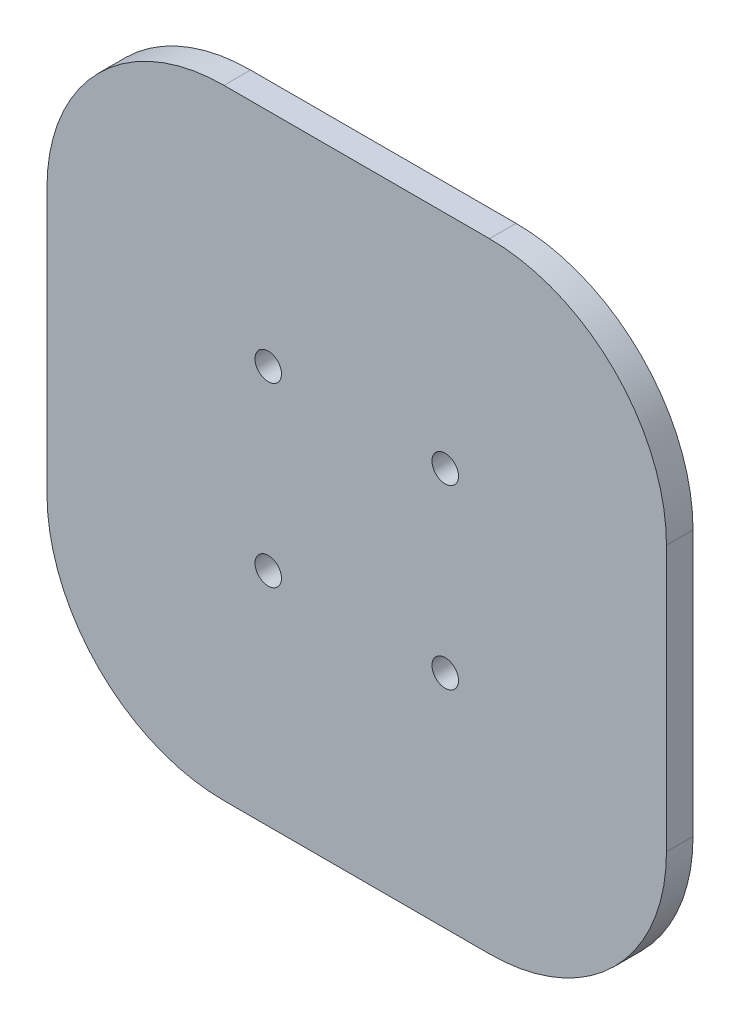
ISO-10303-21;
HEADER;
FILE_DESCRIPTION(('STEP AP214'),'2;1');
FILE_NAME('part.step','',(''),(''),'','','');
FILE_SCHEMA(('AUTOMOTIVE_DESIGN { 1 0 10303 214 1 1 1 1 }'));
ENDSEC;
DATA;
#1=APPLICATION_CONTEXT('core data for automotive mechanical design processes');
#2=APPLICATION_PROTOCOL_DEFINITION('international standard','automotive_design',2000,#1);
#3=PRODUCT_CONTEXT('',#1,'mechanical');
#4=PRODUCT('Part','Part','',(#3));
#5=PRODUCT_RELATED_PRODUCT_CATEGORY('part','',(#4));
#6=PRODUCT_DEFINITION_FORMATION('','',#4);
#7=PRODUCT_DEFINITION_CONTEXT('part definition',#1,'design');
#8=PRODUCT_DEFINITION('design','',#6,#7);
#9=PRODUCT_DEFINITION_SHAPE('','',#8);
#10=(LENGTH_UNIT() NAMED_UNIT(*) SI_UNIT(.MILLI.,.METRE.));
#11=(NAMED_UNIT(*) PLANE_ANGLE_UNIT() SI_UNIT($,.RADIAN.));
#12=(NAMED_UNIT(*) SI_UNIT($,.STERADIAN.) SOLID_ANGLE_UNIT());
#13=UNCERTAINTY_MEASURE_WITH_UNIT(LENGTH_MEASURE(1.E-05),#10,'distance_accuracy_value','');
#14=(GEOMETRIC_REPRESENTATION_CONTEXT(3) GLOBAL_UNCERTAINTY_ASSIGNED_CONTEXT((#13)) GLOBAL_UNIT_ASSIGNED_CONTEXT((#10,
#11,#12)) REPRESENTATION_CONTEXT('',''));
#15=CARTESIAN_POINT('',(0.,0.,0.));
#16=DIRECTION('',(0.,0.,1.));
#17=DIRECTION('',(1.,0.,0.));
#18=AXIS2_PLACEMENT_3D('',#15,#16,#17);
#19=CARTESIAN_POINT('',(-15.,-15.,3.));
#20=DIRECTION('',(0.,0.,-1.));
#21=DIRECTION('',(-1.,0.,0.));
#22=AXIS2_PLACEMENT_3D('',#19,#20,#21);
#23=CYLINDRICAL_SURFACE('',#22,20.);
#24=CARTESIAN_POINT('',(-15.,-15.,0.));
#25=DIRECTION('',(0.,0.,-1.));
#26=DIRECTION('',(-1.,0.,0.));
#27=AXIS2_PLACEMENT_3D('',#24,#25,#26);
#28=CIRCLE('',#27,20.);
#29=CARTESIAN_POINT('',(-15.,-35.,0.));
#30=VERTEX_POINT('',#29);
#31=CARTESIAN_POINT('',(-35.,-15.,0.));
#32=VERTEX_POINT('',#31);
#33=EDGE_CURVE('E132',#30,#32,#28,.T.);
#34=ORIENTED_EDGE('',*,*,#33,.F.);
#35=DIRECTION('',(0.,0.,-1.));
#36=VECTOR('',#35,1.);
#37=CARTESIAN_POINT('',(-15.,-35.,3.));
#38=LINE('',#37,#36);
#39=CARTESIAN_POINT('',(-15.,-35.,3.));
#40=VERTEX_POINT('',#39);
#41=EDGE_CURVE('E11',#40,#30,#38,.T.);
#42=ORIENTED_EDGE('',*,*,#41,.F.);
#43=CARTESIAN_POINT('',(-15.,-15.,3.));
#44=DIRECTION('',(0.,0.,-1.));
#45=DIRECTION('',(-1.,0.,0.));
#46=AXIS2_PLACEMENT_3D('',#43,#44,#45);
#47=CIRCLE('',#46,20.);
#48=CARTESIAN_POINT('',(-35.,-15.,3.));
#49=VERTEX_POINT('',#48);
#50=EDGE_CURVE('E151',#40,#49,#47,.T.);
#51=ORIENTED_EDGE('',*,*,#50,.T.);
#52=DIRECTION('',(0.,0.,-1.));
#53=VECTOR('',#52,1.);
#54=CARTESIAN_POINT('',(-35.,-15.,3.));
#55=LINE('',#54,#53);
#56=EDGE_CURVE('E36',#49,#32,#55,.T.);
#57=ORIENTED_EDGE('',*,*,#56,.T.);
#58=EDGE_LOOP('',(#34,#42,#51,#57));
#59=FACE_BOUND('',#58,.T.);
#60=ADVANCED_FACE('F33',(#59),#23,.T.);
#61=CARTESIAN_POINT('',(-15.,-35.,3.));
#62=DIRECTION('',(0.,1.,0.));
#63=DIRECTION('',(0.,0.,1.));
#64=AXIS2_PLACEMENT_3D('',#61,#62,#63);
#65=PLANE('',#64);
#66=DIRECTION('',(1.,0.,0.));
#67=VECTOR('',#66,1.);
#68=CARTESIAN_POINT('',(-15.,-35.,0.));
#69=LINE('',#68,#67);
#70=CARTESIAN_POINT('',(15.,-35.,0.));
#71=VERTEX_POINT('',#70);
#72=EDGE_CURVE('E78',#30,#71,#69,.T.);
#73=ORIENTED_EDGE('',*,*,#72,.T.);
#74=DIRECTION('',(0.,0.,-1.));
#75=VECTOR('',#74,1.);
#76=CARTESIAN_POINT('',(15.,-35.,3.));
#77=LINE('',#76,#75);
#78=CARTESIAN_POINT('',(15.,-35.,3.));
#79=VERTEX_POINT('',#78);
#80=EDGE_CURVE('E42',#79,#71,#77,.T.);
#81=ORIENTED_EDGE('',*,*,#80,.F.);
#82=DIRECTION('',(1.,0.,0.));
#83=VECTOR('',#82,1.);
#84=CARTESIAN_POINT('',(-15.,-35.,3.));
#85=LINE('',#84,#83);
#86=EDGE_CURVE('E110',#40,#79,#85,.T.);
#87=ORIENTED_EDGE('',*,*,#86,.F.);
#88=ORIENTED_EDGE('',*,*,#41,.T.);
#89=EDGE_LOOP('',(#73,#81,#87,#88));
#90=FACE_BOUND('',#89,.T.);
#91=ADVANCED_FACE('F230',(#90),#65,.F.);
#92=CARTESIAN_POINT('',(15.,-15.,3.));
#93=DIRECTION('',(0.,0.,-1.));
#94=DIRECTION('',(-1.,0.,0.));
#95=AXIS2_PLACEMENT_3D('',#92,#93,#94);
#96=CYLINDRICAL_SURFACE('',#95,20.);
#97=CARTESIAN_POINT('',(15.,-15.,0.));
#98=DIRECTION('',(0.,0.,1.));
#99=DIRECTION('',(1.,0.,0.));
#100=AXIS2_PLACEMENT_3D('',#97,#98,#99);
#101=CIRCLE('',#100,20.);
#102=CARTESIAN_POINT('',(35.,-15.,0.));
#103=VERTEX_POINT('',#102);
#104=EDGE_CURVE('E117',#71,#103,#101,.T.);
#105=ORIENTED_EDGE('',*,*,#104,.T.);
#106=DIRECTION('',(0.,0.,-1.));
#107=VECTOR('',#106,1.);
#108=CARTESIAN_POINT('',(35.,-15.,3.));
#109=LINE('',#108,#107);
#110=CARTESIAN_POINT('',(35.,-15.,3.));
#111=VERTEX_POINT('',#110);
#112=EDGE_CURVE('E114',#111,#103,#109,.T.);
#113=ORIENTED_EDGE('',*,*,#112,.F.);
#114=CARTESIAN_POINT('',(15.,-15.,3.));
#115=DIRECTION('',(0.,0.,1.));
#116=DIRECTION('',(1.,0.,0.));
#117=AXIS2_PLACEMENT_3D('',#114,#115,#116);
#118=CIRCLE('',#117,20.);
#119=EDGE_CURVE('E102',#79,#111,#118,.T.);
#120=ORIENTED_EDGE('',*,*,#119,.F.);
#121=ORIENTED_EDGE('',*,*,#80,.T.);
#122=EDGE_LOOP('',(#105,#113,#120,#121));
#123=FACE_BOUND('',#122,.T.);
#124=ADVANCED_FACE('F115',(#123),#96,.T.);
#125=CARTESIAN_POINT('',(35.,-15.,3.));
#126=DIRECTION('',(-1.,0.,0.));
#127=DIRECTION('',(0.,0.,1.));
#128=AXIS2_PLACEMENT_3D('',#125,#126,#127);
#129=PLANE('',#128);
#130=DIRECTION('',(0.,1.,0.));
#131=VECTOR('',#130,1.);
#132=CARTESIAN_POINT('',(35.,-15.,0.));
#133=LINE('',#132,#131);
#134=CARTESIAN_POINT('',(35.,15.,0.));
#135=VERTEX_POINT('',#134);
#136=EDGE_CURVE('E148',#103,#135,#133,.T.);
#137=ORIENTED_EDGE('',*,*,#136,.T.);
#138=DIRECTION('',(0.,0.,-1.));
#139=VECTOR('',#138,1.);
#140=CARTESIAN_POINT('',(35.,15.,3.));
#141=LINE('',#140,#139);
#142=CARTESIAN_POINT('',(35.,15.,3.));
#143=VERTEX_POINT('',#142);
#144=EDGE_CURVE('E121',#143,#135,#141,.T.);
#145=ORIENTED_EDGE('',*,*,#144,.F.);
#146=DIRECTION('',(0.,1.,0.));
#147=VECTOR('',#146,1.);
#148=CARTESIAN_POINT('',(35.,-15.,3.));
#149=LINE('',#148,#147);
#150=EDGE_CURVE('E108',#111,#143,#149,.T.);
#151=ORIENTED_EDGE('',*,*,#150,.F.);
#152=ORIENTED_EDGE('',*,*,#112,.T.);
#153=EDGE_LOOP('',(#137,#145,#151,#152));
#154=FACE_BOUND('',#153,.T.);
#155=ADVANCED_FACE('F123',(#154),#129,.F.);
#156=CARTESIAN_POINT('',(15.,15.,3.));
#157=DIRECTION('',(0.,0.,-1.));
#158=DIRECTION('',(-1.,0.,0.));
#159=AXIS2_PLACEMENT_3D('',#156,#157,#158);
#160=CYLINDRICAL_SURFACE('',#159,20.);
#161=CARTESIAN_POINT('',(15.,15.,0.));
#162=DIRECTION('',(0.,0.,-1.));
#163=DIRECTION('',(-1.,0.,0.));
#164=AXIS2_PLACEMENT_3D('',#161,#162,#163);
#165=CIRCLE('',#164,20.);
#166=CARTESIAN_POINT('',(15.,35.,0.));
#167=VERTEX_POINT('',#166);
#168=EDGE_CURVE('E145',#167,#135,#165,.T.);
#169=ORIENTED_EDGE('',*,*,#168,.F.);
#170=DIRECTION('',(0.,0.,-1.));
#171=VECTOR('',#170,1.);
#172=CARTESIAN_POINT('',(15.,35.,3.));
#173=LINE('',#172,#171);
#174=CARTESIAN_POINT('',(15.,35.,3.));
#175=VERTEX_POINT('',#174);
#176=EDGE_CURVE('E155',#175,#167,#173,.T.);
#177=ORIENTED_EDGE('',*,*,#176,.F.);
#178=CARTESIAN_POINT('',(15.,15.,3.));
#179=DIRECTION('',(0.,0.,-1.));
#180=DIRECTION('',(-1.,0.,0.));
#181=AXIS2_PLACEMENT_3D('',#178,#179,#180);
#182=CIRCLE('',#181,20.);
#183=EDGE_CURVE('E125',#175,#143,#182,.T.);
#184=ORIENTED_EDGE('',*,*,#183,.T.);
#185=ORIENTED_EDGE('',*,*,#144,.T.);
#186=EDGE_LOOP('',(#169,#177,#184,#185));
#187=FACE_BOUND('',#186,.T.);
#188=ADVANCED_FACE('F167',(#187),#160,.T.);
#189=CARTESIAN_POINT('',(-15.,35.,3.));
#190=DIRECTION('',(0.,1.,0.));
#191=DIRECTION('',(0.,0.,1.));
#192=AXIS2_PLACEMENT_3D('',#189,#190,#191);
#193=PLANE('',#192);
#194=DIRECTION('',(1.,0.,0.));
#195=VECTOR('',#194,1.);
#196=CARTESIAN_POINT('',(-15.,35.,0.));
#197=LINE('',#196,#195);
#198=CARTESIAN_POINT('',(-15.,35.,0.));
#199=VERTEX_POINT('',#198);
#200=EDGE_CURVE('E142',#199,#167,#197,.T.);
#201=ORIENTED_EDGE('',*,*,#200,.F.);
#202=DIRECTION('',(0.,0.,-1.));
#203=VECTOR('',#202,1.);
#204=CARTESIAN_POINT('',(-15.,35.,3.));
#205=LINE('',#204,#203);
#206=CARTESIAN_POINT('',(-15.,35.,3.));
#207=VERTEX_POINT('',#206);
#208=EDGE_CURVE('E157',#207,#199,#205,.T.);
#209=ORIENTED_EDGE('',*,*,#208,.F.);
#210=DIRECTION('',(1.,0.,0.));
#211=VECTOR('',#210,1.);
#212=CARTESIAN_POINT('',(-15.,35.,3.));
#213=LINE('',#212,#211);
#214=EDGE_CURVE('E127',#207,#175,#213,.T.);
#215=ORIENTED_EDGE('',*,*,#214,.T.);
#216=ORIENTED_EDGE('',*,*,#176,.T.);
#217=EDGE_LOOP('',(#201,#209,#215,#216));
#218=FACE_BOUND('',#217,.T.);
#219=ADVANCED_FACE('F171',(#218),#193,.T.);
#220=CARTESIAN_POINT('',(-15.,15.,3.));
#221=DIRECTION('',(0.,0.,-1.));
#222=DIRECTION('',(-1.,0.,0.));
#223=AXIS2_PLACEMENT_3D('',#220,#221,#222);
#224=CYLINDRICAL_SURFACE('',#223,20.);
#225=CARTESIAN_POINT('',(-15.,15.,0.));
#226=DIRECTION('',(0.,0.,1.));
#227=DIRECTION('',(1.,0.,0.));
#228=AXIS2_PLACEMENT_3D('',#225,#226,#227);
#229=CIRCLE('',#228,20.);
#230=CARTESIAN_POINT('',(-35.,15.,0.));
#231=VERTEX_POINT('',#230);
#232=EDGE_CURVE('E139',#199,#231,#229,.T.);
#233=ORIENTED_EDGE('',*,*,#232,.T.);
#234=DIRECTION('',(0.,0.,-1.));
#235=VECTOR('',#234,1.);
#236=CARTESIAN_POINT('',(-35.,15.,3.));
#237=LINE('',#236,#235);
#238=CARTESIAN_POINT('',(-35.,15.,3.));
#239=VERTEX_POINT('',#238);
#240=EDGE_CURVE('E158',#239,#231,#237,.T.);
#241=ORIENTED_EDGE('',*,*,#240,.F.);
#242=CARTESIAN_POINT('',(-15.,15.,3.));
#243=DIRECTION('',(0.,0.,1.));
#244=DIRECTION('',(1.,0.,0.));
#245=AXIS2_PLACEMENT_3D('',#242,#243,#244);
#246=CIRCLE('',#245,20.);
#247=EDGE_CURVE('E173',#207,#239,#246,.T.);
#248=ORIENTED_EDGE('',*,*,#247,.F.);
#249=ORIENTED_EDGE('',*,*,#208,.T.);
#250=EDGE_LOOP('',(#233,#241,#248,#249));
#251=FACE_BOUND('',#250,.T.);
#252=ADVANCED_FACE('F246',(#251),#224,.T.);
#253=CARTESIAN_POINT('',(-35.,-15.,3.));
#254=DIRECTION('',(-1.,0.,0.));
#255=DIRECTION('',(0.,0.,1.));
#256=AXIS2_PLACEMENT_3D('',#253,#254,#255);
#257=PLANE('',#256);
#258=DIRECTION('',(0.,1.,0.));
#259=VECTOR('',#258,1.);
#260=CARTESIAN_POINT('',(-35.,-15.,0.));
#261=LINE('',#260,#259);
#262=EDGE_CURVE('E135',#32,#231,#261,.T.);
#263=ORIENTED_EDGE('',*,*,#262,.F.);
#264=ORIENTED_EDGE('',*,*,#56,.F.);
#265=DIRECTION('',(0.,1.,0.));
#266=VECTOR('',#265,1.);
#267=CARTESIAN_POINT('',(-35.,-15.,3.));
#268=LINE('',#267,#266);
#269=EDGE_CURVE('E174',#49,#239,#268,.T.);
#270=ORIENTED_EDGE('',*,*,#269,.T.);
#271=ORIENTED_EDGE('',*,*,#240,.T.);
#272=EDGE_LOOP('',(#263,#264,#270,#271));
#273=FACE_BOUND('',#272,.T.);
#274=ADVANCED_FACE('F160',(#273),#257,.T.);
#275=CARTESIAN_POINT('',(-15.,-15.,3.));
#276=DIRECTION('',(0.,0.,-1.));
#277=DIRECTION('',(-1.,0.,0.));
#278=AXIS2_PLACEMENT_3D('',#275,#276,#277);
#279=PLANE('',#278);
#280=CARTESIAN_POINT('',(-10.,-9.99999999999999,3.));
#281=DIRECTION('',(0.,0.,1.));
#282=DIRECTION('',(-1.,0.,0.));
#283=AXIS2_PLACEMENT_3D('',#280,#281,#282);
#284=CIRCLE('',#283,1.5);
#285=CARTESIAN_POINT('',(-11.5,-9.99999999999999,3.));
#286=VERTEX_POINT('',#285);
#287=EDGE_CURVE('E194',#286,#286,#284,.T.);
#288=ORIENTED_EDGE('',*,*,#287,.F.);
#289=EDGE_LOOP('',(#288));
#290=FACE_BOUND('',#289,.T.);
#291=CARTESIAN_POINT('',(10.,-9.99999999999999,3.));
#292=DIRECTION('',(0.,0.,1.));
#293=DIRECTION('',(1.,0.,0.));
#294=AXIS2_PLACEMENT_3D('',#291,#292,#293);
#295=CIRCLE('',#294,1.5);
#296=CARTESIAN_POINT('',(11.5,-9.99999999999999,3.));
#297=VERTEX_POINT('',#296);
#298=EDGE_CURVE('E188',#297,#297,#295,.T.);
#299=ORIENTED_EDGE('',*,*,#298,.F.);
#300=EDGE_LOOP('',(#299));
#301=FACE_BOUND('',#300,.T.);
#302=CARTESIAN_POINT('',(10.,10.,3.));
#303=DIRECTION('',(0.,0.,1.));
#304=DIRECTION('',(-1.,0.,0.));
#305=AXIS2_PLACEMENT_3D('',#302,#303,#304);
#306=CIRCLE('',#305,1.5);
#307=CARTESIAN_POINT('',(8.50000000000002,10.,3.));
#308=VERTEX_POINT('',#307);
#309=EDGE_CURVE('E182',#308,#308,#306,.T.);
#310=ORIENTED_EDGE('',*,*,#309,.F.);
#311=EDGE_LOOP('',(#310));
#312=FACE_BOUND('',#311,.T.);
#313=CARTESIAN_POINT('',(-10.,10.,3.));
#314=DIRECTION('',(0.,0.,1.));
#315=DIRECTION('',(1.,0.,0.));
#316=AXIS2_PLACEMENT_3D('',#313,#314,#315);
#317=CIRCLE('',#316,1.5);
#318=CARTESIAN_POINT('',(-8.49999999999999,10.,3.));
#319=VERTEX_POINT('',#318);
#320=EDGE_CURVE('E136',#319,#319,#317,.T.);
#321=ORIENTED_EDGE('',*,*,#320,.F.);
#322=EDGE_LOOP('',(#321));
#323=FACE_BOUND('',#322,.T.);
#324=ORIENTED_EDGE('',*,*,#50,.F.);
#325=ORIENTED_EDGE('',*,*,#86,.T.);
#326=ORIENTED_EDGE('',*,*,#119,.T.);
#327=ORIENTED_EDGE('',*,*,#150,.T.);
#328=ORIENTED_EDGE('',*,*,#183,.F.);
#329=ORIENTED_EDGE('',*,*,#214,.F.);
#330=ORIENTED_EDGE('',*,*,#247,.T.);
#331=ORIENTED_EDGE('',*,*,#269,.F.);
#332=EDGE_LOOP('',(#324,#325,#326,#327,#328,#329,#330,#331));
#333=FACE_BOUND('',#332,.T.);
#334=ADVANCED_FACE('F105',(#290,#301,#312,#323,#333),#279,.F.);
#335=CARTESIAN_POINT('',(-15.,-15.,0.));
#336=DIRECTION('',(0.,0.,-1.));
#337=DIRECTION('',(-1.,0.,0.));
#338=AXIS2_PLACEMENT_3D('',#335,#336,#337);
#339=PLANE('',#338);
#340=CARTESIAN_POINT('',(-10.,-9.99999999999999,0.));
#341=DIRECTION('',(0.,0.,-1.));
#342=DIRECTION('',(-1.,0.,0.));
#343=AXIS2_PLACEMENT_3D('',#340,#341,#342);
#344=CIRCLE('',#343,1.5);
#345=CARTESIAN_POINT('',(-11.5,-9.99999999999999,0.));
#346=VERTEX_POINT('',#345);
#347=EDGE_CURVE('E197',#346,#346,#344,.F.);
#348=ORIENTED_EDGE('',*,*,#347,.T.);
#349=EDGE_LOOP('',(#348));
#350=FACE_BOUND('',#349,.T.);
#351=CARTESIAN_POINT('',(10.,-9.99999999999999,0.));
#352=DIRECTION('',(0.,0.,-1.));
#353=DIRECTION('',(-1.,0.,0.));
#354=AXIS2_PLACEMENT_3D('',#351,#352,#353);
#355=CIRCLE('',#354,1.5);
#356=CARTESIAN_POINT('',(8.50000000000002,-9.99999999999999,0.));
#357=VERTEX_POINT('',#356);
#358=EDGE_CURVE('E191',#357,#357,#355,.F.);
#359=ORIENTED_EDGE('',*,*,#358,.T.);
#360=EDGE_LOOP('',(#359));
#361=FACE_BOUND('',#360,.T.);
#362=CARTESIAN_POINT('',(10.,10.,0.));
#363=DIRECTION('',(0.,0.,-1.));
#364=DIRECTION('',(-1.,0.,0.));
#365=AXIS2_PLACEMENT_3D('',#362,#363,#364);
#366=CIRCLE('',#365,1.5);
#367=CARTESIAN_POINT('',(8.50000000000002,10.,0.));
#368=VERTEX_POINT('',#367);
#369=EDGE_CURVE('E185',#368,#368,#366,.F.);
#370=ORIENTED_EDGE('',*,*,#369,.T.);
#371=EDGE_LOOP('',(#370));
#372=FACE_BOUND('',#371,.T.);
#373=CARTESIAN_POINT('',(-10.,10.,0.));
#374=DIRECTION('',(0.,0.,-1.));
#375=DIRECTION('',(-1.,0.,0.));
#376=AXIS2_PLACEMENT_3D('',#373,#374,#375);
#377=CIRCLE('',#376,1.5);
#378=CARTESIAN_POINT('',(-11.5,10.,0.));
#379=VERTEX_POINT('',#378);
#380=EDGE_CURVE('E179',#379,#379,#377,.F.);
#381=ORIENTED_EDGE('',*,*,#380,.T.);
#382=EDGE_LOOP('',(#381));
#383=FACE_BOUND('',#382,.T.);
#384=ORIENTED_EDGE('',*,*,#33,.T.);
#385=ORIENTED_EDGE('',*,*,#262,.T.);
#386=ORIENTED_EDGE('',*,*,#232,.F.);
#387=ORIENTED_EDGE('',*,*,#200,.T.);
#388=ORIENTED_EDGE('',*,*,#168,.T.);
#389=ORIENTED_EDGE('',*,*,#136,.F.);
#390=ORIENTED_EDGE('',*,*,#104,.F.);
#391=ORIENTED_EDGE('',*,*,#72,.F.);
#392=EDGE_LOOP('',(#384,#385,#386,#387,#388,#389,#390,#391));
#393=FACE_BOUND('',#392,.T.);
#394=ADVANCED_FACE('F163',(#350,#361,#372,#383,#393),#339,.T.);
#395=CARTESIAN_POINT('',(-10.,10.,-0.00100000000000013));
#396=DIRECTION('',(0.,0.,1.));
#397=DIRECTION('',(1.,0.,0.));
#398=AXIS2_PLACEMENT_3D('',#395,#396,#397);
#399=CYLINDRICAL_SURFACE('',#398,1.5);
#400=ORIENTED_EDGE('',*,*,#380,.F.);
#401=EDGE_LOOP('',(#400));
#402=FACE_BOUND('',#401,.T.);
#403=ORIENTED_EDGE('',*,*,#320,.T.);
#404=EDGE_LOOP('',(#403));
#405=FACE_BOUND('',#404,.T.);
#406=ADVANCED_FACE('F214',(#402,#405),#399,.F.);
#407=CARTESIAN_POINT('',(10.,10.,-0.00100000000000013));
#408=DIRECTION('',(0.,0.,1.));
#409=DIRECTION('',(1.,0.,0.));
#410=AXIS2_PLACEMENT_3D('',#407,#408,#409);
#411=CYLINDRICAL_SURFACE('',#410,1.5);
#412=ORIENTED_EDGE('',*,*,#369,.F.);
#413=EDGE_LOOP('',(#412));
#414=FACE_BOUND('',#413,.T.);
#415=ORIENTED_EDGE('',*,*,#309,.T.);
#416=EDGE_LOOP('',(#415));
#417=FACE_BOUND('',#416,.T.);
#418=ADVANCED_FACE('F216',(#414,#417),#411,.F.);
#419=CARTESIAN_POINT('',(10.,-9.99999999999999,-0.00100000000000013));
#420=DIRECTION('',(0.,0.,1.));
#421=DIRECTION('',(1.,0.,0.));
#422=AXIS2_PLACEMENT_3D('',#419,#420,#421);
#423=CYLINDRICAL_SURFACE('',#422,1.5);
#424=ORIENTED_EDGE('',*,*,#358,.F.);
#425=EDGE_LOOP('',(#424));
#426=FACE_BOUND('',#425,.T.);
#427=ORIENTED_EDGE('',*,*,#298,.T.);
#428=EDGE_LOOP('',(#427));
#429=FACE_BOUND('',#428,.T.);
#430=ADVANCED_FACE('F223',(#426,#429),#423,.F.);
#431=CARTESIAN_POINT('',(-10.,-9.99999999999999,-0.00100000000000013));
#432=DIRECTION('',(0.,0.,1.));
#433=DIRECTION('',(1.,0.,0.));
#434=AXIS2_PLACEMENT_3D('',#431,#432,#433);
#435=CYLINDRICAL_SURFACE('',#434,1.5);
#436=ORIENTED_EDGE('',*,*,#347,.F.);
#437=EDGE_LOOP('',(#436));
#438=FACE_BOUND('',#437,.T.);
#439=ORIENTED_EDGE('',*,*,#287,.T.);
#440=EDGE_LOOP('',(#439));
#441=FACE_BOUND('',#440,.T.);
#442=ADVANCED_FACE('F203',(#438,#441),#435,.F.);
#443=CLOSED_SHELL('',(#60,#91,#124,#155,#188,#219,#252,#274,#334,#394,#406,#418,#430,#442));
#444=MANIFOLD_SOLID_BREP('B2',#443);
#445=ADVANCED_BREP_SHAPE_REPRESENTATION('',(#18,#444),#14);
#446=SHAPE_DEFINITION_REPRESENTATION(#9,#445);
ENDSEC;
END-ISO-10303-21;
